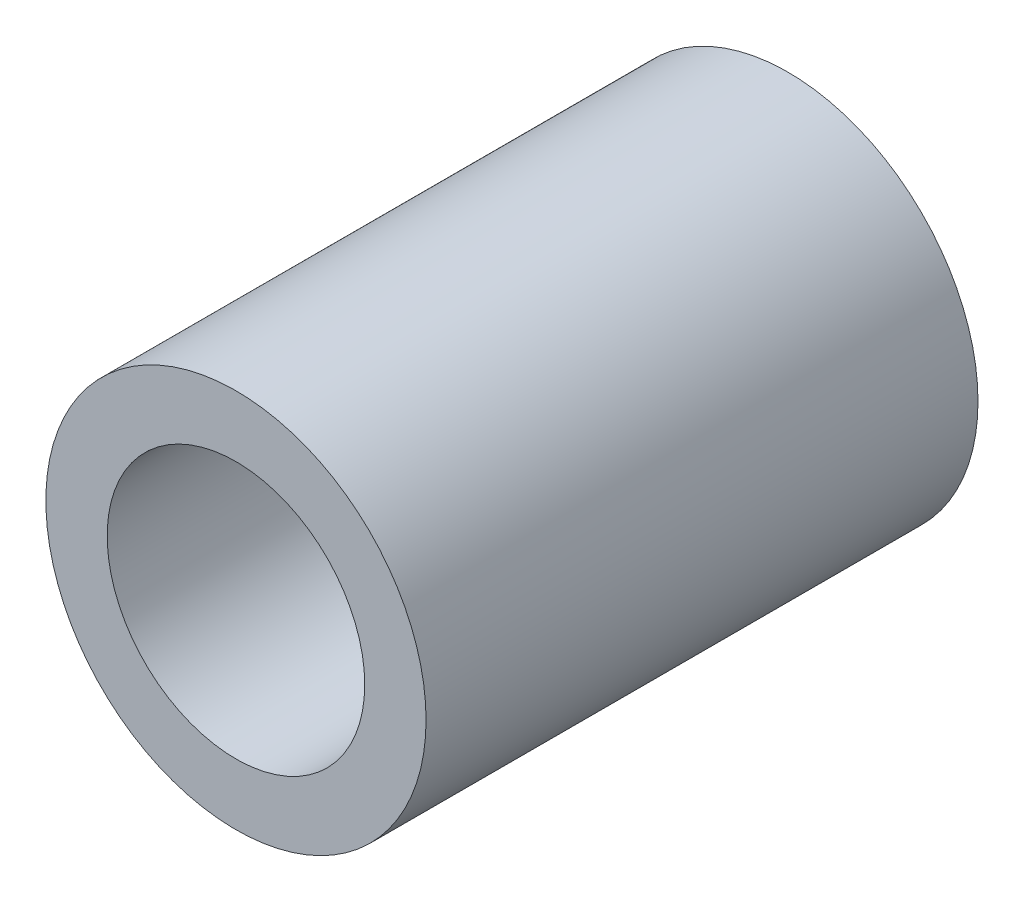
ISO-10303-21;
HEADER;
FILE_DESCRIPTION(('STEP AP214'),'2;1');
FILE_NAME('part.step','',(''),(''),'','','');
FILE_SCHEMA(('AUTOMOTIVE_DESIGN { 1 0 10303 214 1 1 1 1 }'));
ENDSEC;
DATA;
#1=APPLICATION_CONTEXT('core data for automotive mechanical design processes');
#2=APPLICATION_PROTOCOL_DEFINITION('international standard','automotive_design',2000,#1);
#3=PRODUCT_CONTEXT('',#1,'mechanical');
#4=PRODUCT('Part','Part','',(#3));
#5=PRODUCT_RELATED_PRODUCT_CATEGORY('part','',(#4));
#6=PRODUCT_DEFINITION_FORMATION('','',#4);
#7=PRODUCT_DEFINITION_CONTEXT('part definition',#1,'design');
#8=PRODUCT_DEFINITION('design','',#6,#7);
#9=PRODUCT_DEFINITION_SHAPE('','',#8);
#10=(LENGTH_UNIT() NAMED_UNIT(*) SI_UNIT(.MILLI.,.METRE.));
#11=(NAMED_UNIT(*) PLANE_ANGLE_UNIT() SI_UNIT($,.RADIAN.));
#12=(NAMED_UNIT(*) SI_UNIT($,.STERADIAN.) SOLID_ANGLE_UNIT());
#13=UNCERTAINTY_MEASURE_WITH_UNIT(LENGTH_MEASURE(1.E-05),#10,'distance_accuracy_value','');
#14=(GEOMETRIC_REPRESENTATION_CONTEXT(3) GLOBAL_UNCERTAINTY_ASSIGNED_CONTEXT((#13)) GLOBAL_UNIT_ASSIGNED_CONTEXT((#10,
#11,#12)) REPRESENTATION_CONTEXT('',''));
#15=CARTESIAN_POINT('',(0.,0.,0.));
#16=DIRECTION('',(0.,0.,1.));
#17=DIRECTION('',(1.,0.,0.));
#18=AXIS2_PLACEMENT_3D('',#15,#16,#17);
#19=CARTESIAN_POINT('',(0.,0.,9.));
#20=DIRECTION('',(0.,0.,1.));
#21=DIRECTION('',(1.,0.,0.));
#22=AXIS2_PLACEMENT_3D('',#19,#20,#21);
#23=PLANE('',#22);
#24=CARTESIAN_POINT('',(0.,0.,9.));
#25=DIRECTION('',(0.,0.,1.));
#26=DIRECTION('',(1.,0.,0.));
#27=AXIS2_PLACEMENT_3D('',#24,#25,#26);
#28=CIRCLE('',#27,3.1);
#29=CARTESIAN_POINT('',(3.1,0.,9.));
#30=VERTEX_POINT('',#29);
#31=EDGE_CURVE('E10',#30,#30,#28,.T.);
#32=ORIENTED_EDGE('',*,*,#31,.T.);
#33=EDGE_LOOP('',(#32));
#34=FACE_BOUND('',#33,.T.);
#35=CARTESIAN_POINT('',(0.,0.,9.));
#36=DIRECTION('',(0.,0.,1.));
#37=DIRECTION('',(1.,0.,0.));
#38=AXIS2_PLACEMENT_3D('',#35,#36,#37);
#39=CIRCLE('',#38,2.1);
#40=CARTESIAN_POINT('',(2.1,0.,9.));
#41=VERTEX_POINT('',#40);
#42=EDGE_CURVE('E50',#41,#41,#39,.T.);
#43=ORIENTED_EDGE('',*,*,#42,.F.);
#44=EDGE_LOOP('',(#43));
#45=FACE_BOUND('',#44,.T.);
#46=ADVANCED_FACE('F37',(#34,#45),#23,.T.);
#47=CARTESIAN_POINT('',(0.,0.,0.));
#48=DIRECTION('',(0.,0.,1.));
#49=DIRECTION('',(1.,0.,0.));
#50=AXIS2_PLACEMENT_3D('',#47,#48,#49);
#51=PLANE('',#50);
#52=CARTESIAN_POINT('',(0.,0.,0.));
#53=DIRECTION('',(0.,0.,1.));
#54=DIRECTION('',(1.,0.,0.));
#55=AXIS2_PLACEMENT_3D('',#52,#53,#54);
#56=CIRCLE('',#55,3.1);
#57=CARTESIAN_POINT('',(3.1,0.,0.));
#58=VERTEX_POINT('',#57);
#59=EDGE_CURVE('E41',#58,#58,#56,.T.);
#60=ORIENTED_EDGE('',*,*,#59,.F.);
#61=EDGE_LOOP('',(#60));
#62=FACE_BOUND('',#61,.T.);
#63=CARTESIAN_POINT('',(0.,0.,0.));
#64=DIRECTION('',(0.,0.,1.));
#65=DIRECTION('',(1.,0.,0.));
#66=AXIS2_PLACEMENT_3D('',#63,#64,#65);
#67=CIRCLE('',#66,2.1);
#68=CARTESIAN_POINT('',(2.1,0.,0.));
#69=VERTEX_POINT('',#68);
#70=EDGE_CURVE('E52',#69,#69,#67,.T.);
#71=ORIENTED_EDGE('',*,*,#70,.T.);
#72=EDGE_LOOP('',(#71));
#73=FACE_BOUND('',#72,.T.);
#74=ADVANCED_FACE('F64',(#62,#73),#51,.F.);
#75=CARTESIAN_POINT('',(0.,0.,9.));
#76=DIRECTION('',(0.,0.,-1.));
#77=DIRECTION('',(-1.,0.,0.));
#78=AXIS2_PLACEMENT_3D('',#75,#76,#77);
#79=CYLINDRICAL_SURFACE('',#78,3.1);
#80=ORIENTED_EDGE('',*,*,#31,.F.);
#81=EDGE_LOOP('',(#80));
#82=FACE_BOUND('',#81,.T.);
#83=ORIENTED_EDGE('',*,*,#59,.T.);
#84=EDGE_LOOP('',(#83));
#85=FACE_BOUND('',#84,.T.);
#86=ADVANCED_FACE('F39',(#82,#85),#79,.T.);
#87=CARTESIAN_POINT('',(0.,0.,9.));
#88=DIRECTION('',(0.,0.,-1.));
#89=DIRECTION('',(-1.,0.,0.));
#90=AXIS2_PLACEMENT_3D('',#87,#88,#89);
#91=CYLINDRICAL_SURFACE('',#90,2.1);
#92=ORIENTED_EDGE('',*,*,#42,.T.);
#93=EDGE_LOOP('',(#92));
#94=FACE_BOUND('',#93,.T.);
#95=ORIENTED_EDGE('',*,*,#70,.F.);
#96=EDGE_LOOP('',(#95));
#97=FACE_BOUND('',#96,.T.);
#98=ADVANCED_FACE('F60',(#94,#97),#91,.F.);
#99=CLOSED_SHELL('',(#46,#74,#86,#98));
#100=MANIFOLD_SOLID_BREP('B2',#99);
#101=ADVANCED_BREP_SHAPE_REPRESENTATION('',(#18,#100),#14);
#102=SHAPE_DEFINITION_REPRESENTATION(#9,#101);
ENDSEC;
END-ISO-10303-21;
